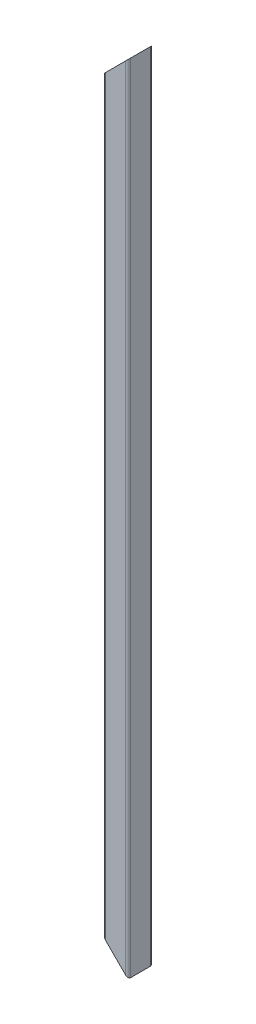
ISO-10303-21;
HEADER;
FILE_DESCRIPTION(('STEP AP214'),'2;1');
FILE_NAME('part.step','',(''),(''),'','','');
FILE_SCHEMA(('AUTOMOTIVE_DESIGN { 1 0 10303 214 1 1 1 1 }'));
ENDSEC;
DATA;
#1=APPLICATION_CONTEXT('core data for automotive mechanical design processes');
#2=APPLICATION_PROTOCOL_DEFINITION('international standard','automotive_design',2000,#1);
#3=PRODUCT_CONTEXT('',#1,'mechanical');
#4=PRODUCT('Part','Part','',(#3));
#5=PRODUCT_RELATED_PRODUCT_CATEGORY('part','',(#4));
#6=PRODUCT_DEFINITION_FORMATION('','',#4);
#7=PRODUCT_DEFINITION_CONTEXT('part definition',#1,'design');
#8=PRODUCT_DEFINITION('design','',#6,#7);
#9=PRODUCT_DEFINITION_SHAPE('','',#8);
#10=(LENGTH_UNIT() NAMED_UNIT(*) SI_UNIT(.MILLI.,.METRE.));
#11=(NAMED_UNIT(*) PLANE_ANGLE_UNIT() SI_UNIT($,.RADIAN.));
#12=(NAMED_UNIT(*) SI_UNIT($,.STERADIAN.) SOLID_ANGLE_UNIT());
#13=UNCERTAINTY_MEASURE_WITH_UNIT(LENGTH_MEASURE(1.E-05),#10,'distance_accuracy_value','');
#14=(GEOMETRIC_REPRESENTATION_CONTEXT(3) GLOBAL_UNCERTAINTY_ASSIGNED_CONTEXT((#13)) GLOBAL_UNIT_ASSIGNED_CONTEXT((#10,
#11,#12)) REPRESENTATION_CONTEXT('',''));
#15=CARTESIAN_POINT('',(0.,0.,0.));
#16=DIRECTION('',(0.,0.,1.));
#17=DIRECTION('',(1.,0.,0.));
#18=AXIS2_PLACEMENT_3D('',#15,#16,#17);
#19=CARTESIAN_POINT('',(253.,215.,-72.4999999999838));
#20=DIRECTION('',(0.,1.,0.));
#21=DIRECTION('',(0.,0.,1.));
#22=AXIS2_PLACEMENT_3D('',#19,#20,#21);
#23=CYLINDRICAL_SURFACE('',#22,3.);
#24=CARTESIAN_POINT('',(253.,-12.9999999999998,-72.4999999999838));
#25=DIRECTION('',(-0.707106781186548,-0.707106781186547,0.));
#26=DIRECTION('',(-0.707106781186547,0.707106781186548,0.));
#27=AXIS2_PLACEMENT_3D('',#24,#25,#26);
#28=ELLIPSE('',#27,4.24264068711929,3.);
#29=CARTESIAN_POINT('',(253.,-13.,-69.4999999999833));
#30=VERTEX_POINT('',#29);
#31=CARTESIAN_POINT('',(250.,-9.99999999999987,-72.499999999984));
#32=VERTEX_POINT('',#31);
#33=EDGE_CURVE('E20',#30,#32,#28,.T.);
#34=ORIENTED_EDGE('',*,*,#33,.F.);
#35=DIRECTION('',(0.,1.,0.));
#36=VECTOR('',#35,1.);
#37=CARTESIAN_POINT('',(253.,440.,-69.4999999999839));
#38=LINE('',#37,#36);
#39=CARTESIAN_POINT('',(253.,893.,-69.4999999999838));
#40=VERTEX_POINT('',#39);
#41=EDGE_CURVE('E111',#40,#30,#38,.F.);
#42=ORIENTED_EDGE('',*,*,#41,.F.);
#43=CARTESIAN_POINT('',(253.,893.,-72.4999999999838));
#44=DIRECTION('',(-0.707106781186547,0.707106781186548,0.));
#45=DIRECTION('',(0.707106781186548,0.707106781186547,0.));
#46=AXIS2_PLACEMENT_3D('',#43,#44,#45);
#47=ELLIPSE('',#46,4.24264068711928,3.);
#48=CARTESIAN_POINT('',(250.,890.,-72.499999999984));
#49=VERTEX_POINT('',#48);
#50=EDGE_CURVE('E82',#49,#40,#47,.T.);
#51=ORIENTED_EDGE('',*,*,#50,.F.);
#52=DIRECTION('',(0.,1.,0.));
#53=VECTOR('',#52,1.);
#54=CARTESIAN_POINT('',(250.,-9.99999999999995,-72.4999999999841));
#55=LINE('',#54,#53);
#56=EDGE_CURVE('E79',#32,#49,#55,.T.);
#57=ORIENTED_EDGE('',*,*,#56,.F.);
#58=EDGE_LOOP('',(#34,#42,#51,#57));
#59=FACE_BOUND('',#58,.T.);
#60=ADVANCED_FACE('F17',(#59),#23,.T.);
#61=CARTESIAN_POINT('',(1.05345683867447E-13,440.,-69.5000000000048));
#62=DIRECTION('',(0.,0.,1.));
#63=DIRECTION('',(1.,0.,0.));
#64=AXIS2_PLACEMENT_3D('',#61,#62,#63);
#65=PLANE('',#64);
#66=DIRECTION('',(0.,1.,0.));
#67=VECTOR('',#66,1.);
#68=CARTESIAN_POINT('',(277.,680.,-69.4999999999818));
#69=LINE('',#68,#67);
#70=CARTESIAN_POINT('',(277.,917.,-69.4999999999823));
#71=VERTEX_POINT('',#70);
#72=CARTESIAN_POINT('',(277.,-37.,-69.4999999999818));
#73=VERTEX_POINT('',#72);
#74=EDGE_CURVE('E103',#71,#73,#69,.F.);
#75=ORIENTED_EDGE('',*,*,#74,.F.);
#76=DIRECTION('',(-0.707106781186548,-0.707106781186547,0.));
#77=VECTOR('',#76,1.);
#78=CARTESIAN_POINT('',(250.,890.,-69.4999999999838));
#79=LINE('',#78,#77);
#80=EDGE_CURVE('E122',#40,#71,#79,.F.);
#81=ORIENTED_EDGE('',*,*,#80,.F.);
#82=ORIENTED_EDGE('',*,*,#41,.T.);
#83=DIRECTION('',(0.707106781186547,-0.707106781186548,0.));
#84=VECTOR('',#83,1.);
#85=CARTESIAN_POINT('',(280.,-40.,-69.4999999999818));
#86=LINE('',#85,#84);
#87=EDGE_CURVE('E102',#73,#30,#86,.F.);
#88=ORIENTED_EDGE('',*,*,#87,.F.);
#89=EDGE_LOOP('',(#75,#81,#82,#88));
#90=FACE_BOUND('',#89,.T.);
#91=ADVANCED_FACE('F163',(#90),#65,.T.);
#92=CARTESIAN_POINT('',(2.57682764015499E-12,440.,-99.5000000000048));
#93=DIRECTION('',(0.,0.,-1.));
#94=DIRECTION('',(-1.,0.,0.));
#95=AXIS2_PLACEMENT_3D('',#92,#93,#94);
#96=PLANE('',#95);
#97=DIRECTION('',(0.,1.,0.));
#98=VECTOR('',#97,1.);
#99=CARTESIAN_POINT('',(253.000000000002,215.,-99.4999999999838));
#100=LINE('',#99,#98);
#101=CARTESIAN_POINT('',(253.000000000002,893.,-99.4999999999833));
#102=VERTEX_POINT('',#101);
#103=CARTESIAN_POINT('',(253.000000000002,-12.9999999999995,-99.4999999999838));
#104=VERTEX_POINT('',#103);
#105=EDGE_CURVE('E87',#102,#104,#100,.F.);
#106=ORIENTED_EDGE('',*,*,#105,.F.);
#107=DIRECTION('',(-0.707106781186548,-0.707106781186547,0.));
#108=VECTOR('',#107,1.);
#109=CARTESIAN_POINT('',(250.000000000001,889.999999999999,-99.4999999999818));
#110=LINE('',#109,#108);
#111=CARTESIAN_POINT('',(277.000000000002,916.999999999999,-99.4999999999818));
#112=VERTEX_POINT('',#111);
#113=EDGE_CURVE('E117',#112,#102,#110,.T.);
#114=ORIENTED_EDGE('',*,*,#113,.F.);
#115=DIRECTION('',(0.,-1.,0.));
#116=VECTOR('',#115,1.);
#117=CARTESIAN_POINT('',(277.000000000002,680.,-99.4999999999818));
#118=LINE('',#117,#116);
#119=CARTESIAN_POINT('',(277.000000000002,-36.9999999999994,-99.4999999999823));
#120=VERTEX_POINT('',#119);
#121=EDGE_CURVE('E124',#120,#112,#118,.F.);
#122=ORIENTED_EDGE('',*,*,#121,.F.);
#123=DIRECTION('',(0.707106781186547,-0.707106781186548,0.));
#124=VECTOR('',#123,1.);
#125=CARTESIAN_POINT('',(280.000000000001,-39.9999999999988,-99.4999999999838));
#126=LINE('',#125,#124);
#127=EDGE_CURVE('E129',#104,#120,#126,.T.);
#128=ORIENTED_EDGE('',*,*,#127,.F.);
#129=EDGE_LOOP('',(#106,#114,#122,#128));
#130=FACE_BOUND('',#129,.T.);
#131=ADVANCED_FACE('F154',(#130),#96,.T.);
#132=CARTESIAN_POINT('',(253.000000000002,215.,-96.4999999999838));
#133=DIRECTION('',(0.,1.,0.));
#134=DIRECTION('',(0.,0.,1.));
#135=AXIS2_PLACEMENT_3D('',#132,#133,#134);
#136=CYLINDRICAL_SURFACE('',#135,3.);
#137=CARTESIAN_POINT('',(253.000000000002,-12.9999999999998,-96.4999999999838));
#138=DIRECTION('',(-0.707106781186548,-0.707106781186547,0.));
#139=DIRECTION('',(-0.707106781186547,0.707106781186548,0.));
#140=AXIS2_PLACEMENT_3D('',#137,#138,#139);
#141=ELLIPSE('',#140,4.24264068711929,3.);
#142=CARTESIAN_POINT('',(250.000000000002,-9.99999999999941,-96.4999999999841));
#143=VERTEX_POINT('',#142);
#144=EDGE_CURVE('E96',#143,#104,#141,.T.);
#145=ORIENTED_EDGE('',*,*,#144,.F.);
#146=DIRECTION('',(0.,1.,0.));
#147=VECTOR('',#146,1.);
#148=CARTESIAN_POINT('',(250.000000000002,-9.99999999999995,-96.4999999999841));
#149=LINE('',#148,#147);
#150=CARTESIAN_POINT('',(250.000000000002,890.,-96.499999999984));
#151=VERTEX_POINT('',#150);
#152=EDGE_CURVE('E86',#151,#143,#149,.F.);
#153=ORIENTED_EDGE('',*,*,#152,.F.);
#154=CARTESIAN_POINT('',(253.000000000002,893.,-96.4999999999838));
#155=DIRECTION('',(-0.707106781186547,0.707106781186548,0.));
#156=DIRECTION('',(0.707106781186548,0.707106781186547,0.));
#157=AXIS2_PLACEMENT_3D('',#154,#155,#156);
#158=ELLIPSE('',#157,4.24264068711929,3.);
#159=EDGE_CURVE('E113',#102,#151,#158,.T.);
#160=ORIENTED_EDGE('',*,*,#159,.F.);
#161=ORIENTED_EDGE('',*,*,#105,.T.);
#162=EDGE_LOOP('',(#145,#153,#160,#161));
#163=FACE_BOUND('',#162,.T.);
#164=ADVANCED_FACE('F155',(#163),#136,.T.);
#165=CARTESIAN_POINT('',(250.,-9.99999999999995,-69.4999999999841));
#166=DIRECTION('',(-1.,0.,0.));
#167=DIRECTION('',(0.,0.,1.));
#168=AXIS2_PLACEMENT_3D('',#165,#166,#167);
#169=PLANE('',#168);
#170=ORIENTED_EDGE('',*,*,#152,.T.);
#171=DIRECTION('',(0.,0.,1.));
#172=VECTOR('',#171,1.);
#173=CARTESIAN_POINT('',(250.,-9.99999999999996,-69.4999999999816));
#174=LINE('',#173,#172);
#175=EDGE_CURVE('E90',#32,#143,#174,.F.);
#176=ORIENTED_EDGE('',*,*,#175,.F.);
#177=ORIENTED_EDGE('',*,*,#56,.T.);
#178=DIRECTION('',(0.,0.,1.));
#179=VECTOR('',#178,1.);
#180=CARTESIAN_POINT('',(250.000000000001,890.000000000001,-69.4999999999841));
#181=LINE('',#180,#179);
#182=EDGE_CURVE('E116',#151,#49,#181,.T.);
#183=ORIENTED_EDGE('',*,*,#182,.F.);
#184=EDGE_LOOP('',(#170,#176,#177,#183));
#185=FACE_BOUND('',#184,.T.);
#186=ADVANCED_FACE('F91',(#185),#169,.T.);
#187=CARTESIAN_POINT('',(277.,680.,-72.4999999999818));
#188=DIRECTION('',(0.,1.,0.));
#189=DIRECTION('',(0.,0.,1.));
#190=AXIS2_PLACEMENT_3D('',#187,#188,#189);
#191=CYLINDRICAL_SURFACE('',#190,3.);
#192=CARTESIAN_POINT('',(277.,-36.9999999999997,-72.4999999999818));
#193=DIRECTION('',(-0.707106781186548,-0.707106781186547,0.));
#194=DIRECTION('',(-0.707106781186547,0.707106781186548,0.));
#195=AXIS2_PLACEMENT_3D('',#192,#193,#194);
#196=ELLIPSE('',#195,4.24264068711929,3.);
#197=CARTESIAN_POINT('',(280.,-39.9999999999998,-72.4999999999816));
#198=VERTEX_POINT('',#197);
#199=EDGE_CURVE('E128',#198,#73,#196,.T.);
#200=ORIENTED_EDGE('',*,*,#199,.F.);
#201=DIRECTION('',(0.,1.,0.));
#202=VECTOR('',#201,1.);
#203=CARTESIAN_POINT('',(280.,920.,-72.4999999999816));
#204=LINE('',#203,#202);
#205=CARTESIAN_POINT('',(280.,920.,-72.4999999999816));
#206=VERTEX_POINT('',#205);
#207=EDGE_CURVE('E137',#206,#198,#204,.F.);
#208=ORIENTED_EDGE('',*,*,#207,.F.);
#209=CARTESIAN_POINT('',(277.,917.,-72.4999999999818));
#210=DIRECTION('',(-0.707106781186547,0.707106781186548,0.));
#211=DIRECTION('',(0.707106781186548,0.707106781186547,0.));
#212=AXIS2_PLACEMENT_3D('',#209,#210,#211);
#213=ELLIPSE('',#212,4.24264068711928,3.);
#214=EDGE_CURVE('E119',#71,#206,#213,.T.);
#215=ORIENTED_EDGE('',*,*,#214,.F.);
#216=ORIENTED_EDGE('',*,*,#74,.T.);
#217=EDGE_LOOP('',(#200,#208,#215,#216));
#218=FACE_BOUND('',#217,.T.);
#219=ADVANCED_FACE('F160',(#218),#191,.T.);
#220=CARTESIAN_POINT('',(280.,-40.,-69.4999999999816));
#221=DIRECTION('',(-0.707106781186548,-0.707106781186547,0.));
#222=DIRECTION('',(0.707106781186547,-0.707106781186548,0.));
#223=AXIS2_PLACEMENT_3D('',#220,#221,#222);
#224=PLANE('',#223);
#225=ORIENTED_EDGE('',*,*,#199,.T.);
#226=ORIENTED_EDGE('',*,*,#87,.T.);
#227=ORIENTED_EDGE('',*,*,#33,.T.);
#228=ORIENTED_EDGE('',*,*,#175,.T.);
#229=ORIENTED_EDGE('',*,*,#144,.T.);
#230=ORIENTED_EDGE('',*,*,#127,.T.);
#231=CARTESIAN_POINT('',(277.000000000002,-36.9999999999997,-96.4999999999818));
#232=DIRECTION('',(-0.707106781186548,-0.707106781186547,0.));
#233=DIRECTION('',(0.707106781186547,-0.707106781186548,0.));
#234=AXIS2_PLACEMENT_3D('',#231,#232,#233);
#235=ELLIPSE('',#234,4.24264068711929,3.);
#236=CARTESIAN_POINT('',(280.000000000002,-39.9999999999998,-96.4999999999816));
#237=VERTEX_POINT('',#236);
#238=EDGE_CURVE('E125',#237,#120,#235,.F.);
#239=ORIENTED_EDGE('',*,*,#238,.F.);
#240=DIRECTION('',(0.,0.,-1.));
#241=VECTOR('',#240,1.);
#242=CARTESIAN_POINT('',(280.,-39.9999999999999,-69.4999999999816));
#243=LINE('',#242,#241);
#244=EDGE_CURVE('E134',#198,#237,#243,.T.);
#245=ORIENTED_EDGE('',*,*,#244,.F.);
#246=EDGE_LOOP('',(#225,#226,#227,#228,#229,#230,#239,#245));
#247=FACE_BOUND('',#246,.T.);
#248=ADVANCED_FACE('F100',(#247),#224,.T.);
#249=CARTESIAN_POINT('',(277.000000000002,680.,-96.4999999999818));
#250=DIRECTION('',(0.,-1.,0.));
#251=DIRECTION('',(0.,0.,-1.));
#252=AXIS2_PLACEMENT_3D('',#249,#250,#251);
#253=CYLINDRICAL_SURFACE('',#252,3.);
#254=CARTESIAN_POINT('',(277.000000000002,917.,-96.4999999999818));
#255=DIRECTION('',(-0.707106781186547,0.707106781186548,0.));
#256=DIRECTION('',(-0.707106781186548,-0.707106781186547,0.));
#257=AXIS2_PLACEMENT_3D('',#254,#255,#256);
#258=ELLIPSE('',#257,4.24264068711929,3.);
#259=CARTESIAN_POINT('',(280.000000000002,920.,-96.4999999999816));
#260=VERTEX_POINT('',#259);
#261=EDGE_CURVE('E35',#260,#112,#258,.T.);
#262=ORIENTED_EDGE('',*,*,#261,.F.);
#263=DIRECTION('',(0.,1.,0.));
#264=VECTOR('',#263,1.);
#265=CARTESIAN_POINT('',(280.000000000002,920.,-96.4999999999816));
#266=LINE('',#265,#264);
#267=EDGE_CURVE('E26',#237,#260,#266,.T.);
#268=ORIENTED_EDGE('',*,*,#267,.F.);
#269=ORIENTED_EDGE('',*,*,#238,.T.);
#270=ORIENTED_EDGE('',*,*,#121,.T.);
#271=EDGE_LOOP('',(#262,#268,#269,#270));
#272=FACE_BOUND('',#271,.T.);
#273=ADVANCED_FACE('F159',(#272),#253,.T.);
#274=CARTESIAN_POINT('',(250.,890.,-69.4999999999841));
#275=DIRECTION('',(-0.707106781186547,0.707106781186548,0.));
#276=DIRECTION('',(-0.707106781186548,-0.707106781186547,0.));
#277=AXIS2_PLACEMENT_3D('',#274,#275,#276);
#278=PLANE('',#277);
#279=ORIENTED_EDGE('',*,*,#159,.T.);
#280=ORIENTED_EDGE('',*,*,#182,.T.);
#281=ORIENTED_EDGE('',*,*,#50,.T.);
#282=ORIENTED_EDGE('',*,*,#80,.T.);
#283=ORIENTED_EDGE('',*,*,#214,.T.);
#284=DIRECTION('',(0.,0.,-1.));
#285=VECTOR('',#284,1.);
#286=CARTESIAN_POINT('',(280.,920.,-69.4999999999816));
#287=LINE('',#286,#285);
#288=EDGE_CURVE('E11',#260,#206,#287,.F.);
#289=ORIENTED_EDGE('',*,*,#288,.F.);
#290=ORIENTED_EDGE('',*,*,#261,.T.);
#291=ORIENTED_EDGE('',*,*,#113,.T.);
#292=EDGE_LOOP('',(#279,#280,#281,#282,#283,#289,#290,#291));
#293=FACE_BOUND('',#292,.T.);
#294=ADVANCED_FACE('F148',(#293),#278,.T.);
#295=CARTESIAN_POINT('',(280.,920.,-69.4999999999816));
#296=DIRECTION('',(1.,0.,0.));
#297=DIRECTION('',(0.,0.,-1.));
#298=AXIS2_PLACEMENT_3D('',#295,#296,#297);
#299=PLANE('',#298);
#300=ORIENTED_EDGE('',*,*,#267,.T.);
#301=ORIENTED_EDGE('',*,*,#288,.T.);
#302=ORIENTED_EDGE('',*,*,#207,.T.);
#303=ORIENTED_EDGE('',*,*,#244,.T.);
#304=EDGE_LOOP('',(#300,#301,#302,#303));
#305=FACE_BOUND('',#304,.T.);
#306=ADVANCED_FACE('F157',(#305),#299,.T.);
#307=CLOSED_SHELL('',(#60,#91,#131,#164,#186,#219,#248,#273,#294,#306));
#308=MANIFOLD_SOLID_BREP('B1',#307);
#309=ADVANCED_BREP_SHAPE_REPRESENTATION('',(#18,#308),#14);
#310=SHAPE_DEFINITION_REPRESENTATION(#9,#309);
ENDSEC;
END-ISO-10303-21;
